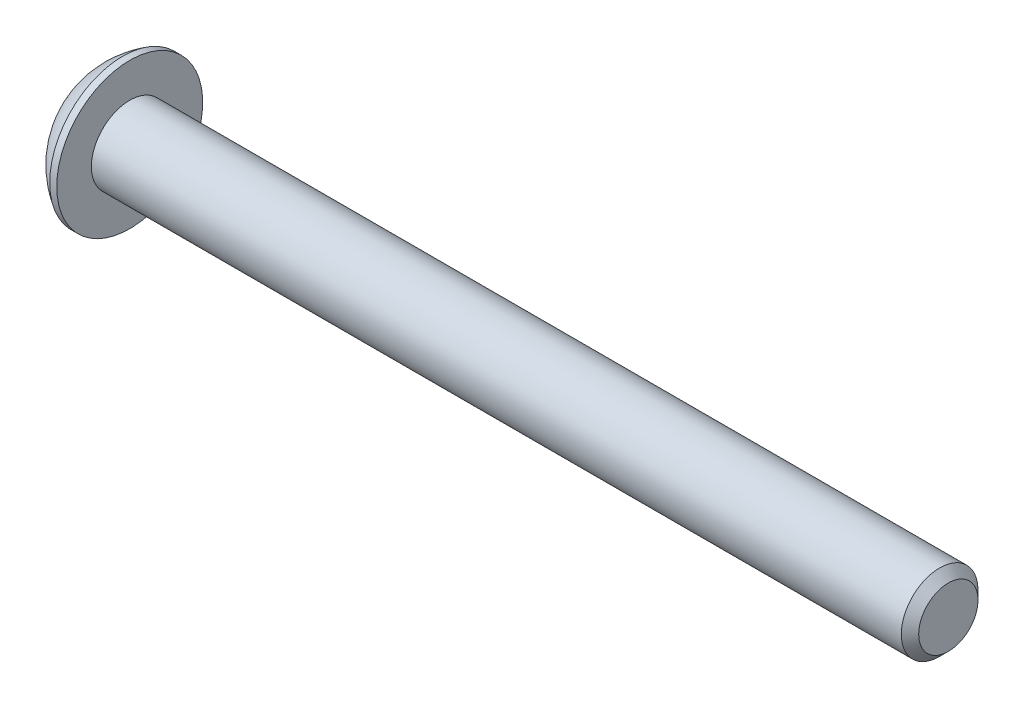
ISO-10303-21;
HEADER;
FILE_DESCRIPTION(('STEP AP214'),'2;1');
FILE_NAME('part.step','',(''),(''),'','','');
FILE_SCHEMA(('AUTOMOTIVE_DESIGN { 1 0 10303 214 1 1 1 1 }'));
ENDSEC;
DATA;
#1=APPLICATION_CONTEXT('core data for automotive mechanical design processes');
#2=APPLICATION_PROTOCOL_DEFINITION('international standard','automotive_design',2000,#1);
#3=PRODUCT_CONTEXT('',#1,'mechanical');
#4=PRODUCT('Part','Part','',(#3));
#5=PRODUCT_RELATED_PRODUCT_CATEGORY('part','',(#4));
#6=PRODUCT_DEFINITION_FORMATION('','',#4);
#7=PRODUCT_DEFINITION_CONTEXT('part definition',#1,'design');
#8=PRODUCT_DEFINITION('design','',#6,#7);
#9=PRODUCT_DEFINITION_SHAPE('','',#8);
#10=(LENGTH_UNIT() NAMED_UNIT(*) SI_UNIT(.MILLI.,.METRE.));
#11=(NAMED_UNIT(*) PLANE_ANGLE_UNIT() SI_UNIT($,.RADIAN.));
#12=(NAMED_UNIT(*) SI_UNIT($,.STERADIAN.) SOLID_ANGLE_UNIT());
#13=UNCERTAINTY_MEASURE_WITH_UNIT(LENGTH_MEASURE(1.E-05),#10,'distance_accuracy_value','');
#14=(GEOMETRIC_REPRESENTATION_CONTEXT(3) GLOBAL_UNCERTAINTY_ASSIGNED_CONTEXT((#13)) GLOBAL_UNIT_ASSIGNED_CONTEXT((#10,
#11,#12)) REPRESENTATION_CONTEXT('',''));
#15=CARTESIAN_POINT('',(0.,0.,0.));
#16=DIRECTION('',(0.,0.,1.));
#17=DIRECTION('',(1.,0.,0.));
#18=AXIS2_PLACEMENT_3D('',#15,#16,#17);
#19=CARTESIAN_POINT('',(1.32080000000034,0.,0.));
#20=DIRECTION('',(-1.,0.,0.));
#21=DIRECTION('',(0.,0.,1.));
#22=AXIS2_PLACEMENT_3D('',#19,#20,#21);
#23=CONICAL_SURFACE('',#22,1.1937999999998,1.04719755119608);
#24=CARTESIAN_POINT('',(2.01004075135902,0.,4.44089209850063E-13));
#25=VERTEX_POINT('',#24);
#26=VERTEX_LOOP('',#25);
#27=FACE_BOUND('',#26,.T.);
#28=CARTESIAN_POINT('',(1.32080000000009,0.,0.));
#29=DIRECTION('',(-1.,0.,0.));
#30=DIRECTION('',(0.,0.,1.));
#31=AXIS2_PLACEMENT_3D('',#28,#29,#30);
#32=CIRCLE('',#31,1.19380000000024);
#33=CARTESIAN_POINT('',(1.32080000000004,0.,1.19380000000012));
#34=VERTEX_POINT('',#33);
#35=CARTESIAN_POINT('',(1.32080000000004,-1.03386112703797,0.596900000000061));
#36=VERTEX_POINT('',#35);
#37=EDGE_CURVE('E20',#34,#36,#32,.F.);
#38=ORIENTED_EDGE('',*,*,#37,.F.);
#39=CARTESIAN_POINT('',(1.32080000000009,0.,0.));
#40=DIRECTION('',(-1.,0.,0.));
#41=DIRECTION('',(0.,0.,1.));
#42=AXIS2_PLACEMENT_3D('',#39,#40,#41);
#43=CIRCLE('',#42,1.19380000000024);
#44=CARTESIAN_POINT('',(1.32080000000004,1.03386112703797,0.596900000000063));
#45=VERTEX_POINT('',#44);
#46=EDGE_CURVE('E90',#45,#34,#43,.F.);
#47=ORIENTED_EDGE('',*,*,#46,.F.);
#48=CARTESIAN_POINT('',(1.32080000000009,0.,0.));
#49=DIRECTION('',(-1.,0.,0.));
#50=DIRECTION('',(0.,0.,1.));
#51=AXIS2_PLACEMENT_3D('',#48,#49,#50);
#52=CIRCLE('',#51,1.19380000000024);
#53=CARTESIAN_POINT('',(1.32080000000004,1.03386112703797,-0.596900000000063));
#54=VERTEX_POINT('',#53);
#55=EDGE_CURVE('E106',#54,#45,#52,.F.);
#56=ORIENTED_EDGE('',*,*,#55,.F.);
#57=CARTESIAN_POINT('',(1.32080000000009,0.,0.));
#58=DIRECTION('',(-1.,0.,0.));
#59=DIRECTION('',(0.,0.,1.));
#60=AXIS2_PLACEMENT_3D('',#57,#58,#59);
#61=CIRCLE('',#60,1.19380000000024);
#62=CARTESIAN_POINT('',(1.32080000000004,1.49420287879031E-12,-1.19380000000012));
#63=VERTEX_POINT('',#62);
#64=EDGE_CURVE('E449',#63,#54,#61,.F.);
#65=ORIENTED_EDGE('',*,*,#64,.F.);
#66=CARTESIAN_POINT('',(1.32080000000009,0.,0.));
#67=DIRECTION('',(-1.,0.,0.));
#68=DIRECTION('',(0.,0.,1.));
#69=AXIS2_PLACEMENT_3D('',#66,#67,#68);
#70=CIRCLE('',#69,1.19380000000024);
#71=CARTESIAN_POINT('',(1.32080000000004,-1.03386112703797,-0.596900000000062));
#72=VERTEX_POINT('',#71);
#73=EDGE_CURVE('E452',#72,#63,#70,.F.);
#74=ORIENTED_EDGE('',*,*,#73,.F.);
#75=CARTESIAN_POINT('',(1.32080000000009,0.,0.));
#76=DIRECTION('',(-1.,0.,0.));
#77=DIRECTION('',(0.,0.,1.));
#78=AXIS2_PLACEMENT_3D('',#75,#76,#77);
#79=CIRCLE('',#78,1.19380000000024);
#80=EDGE_CURVE('E93',#36,#72,#79,.F.);
#81=ORIENTED_EDGE('',*,*,#80,.F.);
#82=EDGE_LOOP('',(#38,#47,#56,#65,#74,#81));
#83=FACE_BOUND('',#82,.T.);
#84=ADVANCED_FACE('F17',(#27,#83),#23,.F.);
#85=CARTESIAN_POINT('',(1.3208,0.,2.3876));
#86=DIRECTION('',(-1.,0.,0.));
#87=DIRECTION('',(0.,0.,1.));
#88=AXIS2_PLACEMENT_3D('',#85,#86,#87);
#89=PLANE('',#88);
#90=DIRECTION('',(0.,1.,0.));
#91=VECTOR('',#90,1.);
#92=CARTESIAN_POINT('',(1.3208,-0.689240751358576,1.1938));
#93=LINE('',#92,#91);
#94=CARTESIAN_POINT('',(1.3208,-0.689240751358576,1.1938));
#95=VERTEX_POINT('',#94);
#96=EDGE_CURVE('E109',#34,#95,#93,.F.);
#97=ORIENTED_EDGE('',*,*,#96,.F.);
#98=ORIENTED_EDGE('',*,*,#37,.T.);
#99=DIRECTION('',(0.,0.5,0.866025403784439));
#100=VECTOR('',#99,1.);
#101=CARTESIAN_POINT('',(1.3208,-1.37848150271715,0.));
#102=LINE('',#101,#100);
#103=EDGE_CURVE('E112',#95,#36,#102,.F.);
#104=ORIENTED_EDGE('',*,*,#103,.F.);
#105=EDGE_LOOP('',(#97,#98,#104));
#106=FACE_BOUND('',#105,.T.);
#107=ADVANCED_FACE('F110',(#106),#89,.T.);
#108=CARTESIAN_POINT('',(1.3208,0.,2.3876));
#109=DIRECTION('',(-1.,0.,0.));
#110=DIRECTION('',(0.,0.,1.));
#111=AXIS2_PLACEMENT_3D('',#108,#109,#110);
#112=PLANE('',#111);
#113=DIRECTION('',(0.,0.5,0.866025403784439));
#114=VECTOR('',#113,1.);
#115=CARTESIAN_POINT('',(1.3208,-1.37848150271715,0.));
#116=LINE('',#115,#114);
#117=CARTESIAN_POINT('',(1.3208,-1.37848150271715,0.));
#118=VERTEX_POINT('',#117);
#119=EDGE_CURVE('E172',#36,#118,#116,.F.);
#120=ORIENTED_EDGE('',*,*,#119,.F.);
#121=ORIENTED_EDGE('',*,*,#80,.T.);
#122=DIRECTION('',(0.,-0.5,0.866025403784439));
#123=VECTOR('',#122,1.);
#124=CARTESIAN_POINT('',(1.3208,-0.689240751358576,-1.1938));
#125=LINE('',#124,#123);
#126=EDGE_CURVE('E160',#118,#72,#125,.F.);
#127=ORIENTED_EDGE('',*,*,#126,.F.);
#128=EDGE_LOOP('',(#120,#121,#127));
#129=FACE_BOUND('',#128,.T.);
#130=ADVANCED_FACE('F249',(#129),#112,.T.);
#131=CARTESIAN_POINT('',(1.3208,0.,2.3876));
#132=DIRECTION('',(-1.,0.,0.));
#133=DIRECTION('',(0.,0.,1.));
#134=AXIS2_PLACEMENT_3D('',#131,#132,#133);
#135=PLANE('',#134);
#136=DIRECTION('',(0.,-0.5,0.866025403784439));
#137=VECTOR('',#136,1.);
#138=CARTESIAN_POINT('',(1.3208,-0.689240751358576,-1.1938));
#139=LINE('',#138,#137);
#140=CARTESIAN_POINT('',(1.3208,-0.689240751358576,-1.1938));
#141=VERTEX_POINT('',#140);
#142=EDGE_CURVE('E157',#72,#141,#139,.F.);
#143=ORIENTED_EDGE('',*,*,#142,.F.);
#144=ORIENTED_EDGE('',*,*,#73,.T.);
#145=DIRECTION('',(0.,-1.,0.));
#146=VECTOR('',#145,1.);
#147=CARTESIAN_POINT('',(1.3208,0.689240751358575,-1.1938));
#148=LINE('',#147,#146);
#149=EDGE_CURVE('E144',#141,#63,#148,.F.);
#150=ORIENTED_EDGE('',*,*,#149,.F.);
#151=EDGE_LOOP('',(#143,#144,#150));
#152=FACE_BOUND('',#151,.T.);
#153=ADVANCED_FACE('F245',(#152),#135,.T.);
#154=CARTESIAN_POINT('',(1.3208,0.,2.3876));
#155=DIRECTION('',(-1.,0.,0.));
#156=DIRECTION('',(0.,0.,1.));
#157=AXIS2_PLACEMENT_3D('',#154,#155,#156);
#158=PLANE('',#157);
#159=DIRECTION('',(0.,-1.,0.));
#160=VECTOR('',#159,1.);
#161=CARTESIAN_POINT('',(1.3208,0.689240751358575,-1.1938));
#162=LINE('',#161,#160);
#163=CARTESIAN_POINT('',(1.3208,0.689240751358575,-1.1938));
#164=VERTEX_POINT('',#163);
#165=EDGE_CURVE('E141',#63,#164,#162,.F.);
#166=ORIENTED_EDGE('',*,*,#165,.F.);
#167=ORIENTED_EDGE('',*,*,#64,.T.);
#168=DIRECTION('',(0.,-0.500000000000001,-0.866025403784438));
#169=VECTOR('',#168,1.);
#170=CARTESIAN_POINT('',(1.3208,1.37848150271715,0.));
#171=LINE('',#170,#169);
#172=EDGE_CURVE('E129',#164,#54,#171,.F.);
#173=ORIENTED_EDGE('',*,*,#172,.F.);
#174=EDGE_LOOP('',(#166,#167,#173));
#175=FACE_BOUND('',#174,.T.);
#176=ADVANCED_FACE('F241',(#175),#158,.T.);
#177=CARTESIAN_POINT('',(1.3208,0.,2.3876));
#178=DIRECTION('',(-1.,0.,0.));
#179=DIRECTION('',(0.,0.,1.));
#180=AXIS2_PLACEMENT_3D('',#177,#178,#179);
#181=PLANE('',#180);
#182=DIRECTION('',(0.,-0.500000000000001,-0.866025403784438));
#183=VECTOR('',#182,1.);
#184=CARTESIAN_POINT('',(1.3208,1.37848150271715,0.));
#185=LINE('',#184,#183);
#186=CARTESIAN_POINT('',(1.3208,1.37848150271715,0.));
#187=VERTEX_POINT('',#186);
#188=EDGE_CURVE('E126',#54,#187,#185,.F.);
#189=ORIENTED_EDGE('',*,*,#188,.F.);
#190=ORIENTED_EDGE('',*,*,#55,.T.);
#191=DIRECTION('',(0.,0.500000000000001,-0.866025403784438));
#192=VECTOR('',#191,1.);
#193=CARTESIAN_POINT('',(1.3208,0.689240751358575,1.1938));
#194=LINE('',#193,#192);
#195=EDGE_CURVE('E149',#187,#45,#194,.F.);
#196=ORIENTED_EDGE('',*,*,#195,.F.);
#197=EDGE_LOOP('',(#189,#190,#196));
#198=FACE_BOUND('',#197,.T.);
#199=ADVANCED_FACE('F238',(#198),#181,.T.);
#200=CARTESIAN_POINT('',(1.3208,0.,2.3876));
#201=DIRECTION('',(-1.,0.,0.));
#202=DIRECTION('',(0.,0.,1.));
#203=AXIS2_PLACEMENT_3D('',#200,#201,#202);
#204=PLANE('',#203);
#205=DIRECTION('',(0.,0.500000000000001,-0.866025403784438));
#206=VECTOR('',#205,1.);
#207=CARTESIAN_POINT('',(1.3208,0.689240751358575,1.1938));
#208=LINE('',#207,#206);
#209=CARTESIAN_POINT('',(1.3208,0.689240751358575,1.1938));
#210=VERTEX_POINT('',#209);
#211=EDGE_CURVE('E104',#45,#210,#208,.F.);
#212=ORIENTED_EDGE('',*,*,#211,.F.);
#213=ORIENTED_EDGE('',*,*,#46,.T.);
#214=DIRECTION('',(0.,1.,0.));
#215=VECTOR('',#214,1.);
#216=CARTESIAN_POINT('',(1.3208,-0.689240751358576,1.1938));
#217=LINE('',#216,#215);
#218=EDGE_CURVE('E101',#210,#34,#217,.F.);
#219=ORIENTED_EDGE('',*,*,#218,.F.);
#220=EDGE_LOOP('',(#212,#213,#219));
#221=FACE_BOUND('',#220,.T.);
#222=ADVANCED_FACE('F99',(#221),#204,.T.);
#223=CARTESIAN_POINT('',(1.3208,-0.689240751358576,1.1938));
#224=DIRECTION('',(0.,0.,-1.));
#225=DIRECTION('',(0.,1.,0.));
#226=AXIS2_PLACEMENT_3D('',#223,#224,#225);
#227=PLANE('',#226);
#228=DIRECTION('',(0.,1.,0.));
#229=VECTOR('',#228,1.);
#230=CARTESIAN_POINT('',(0.,0.,1.1938));
#231=LINE('',#230,#229);
#232=CARTESIAN_POINT('',(0.,0.689240751358575,1.1938));
#233=VERTEX_POINT('',#232);
#234=CARTESIAN_POINT('',(0.,-0.689240751358576,1.1938));
#235=VERTEX_POINT('',#234);
#236=EDGE_CURVE('E133',#233,#235,#231,.F.);
#237=ORIENTED_EDGE('',*,*,#236,.F.);
#238=DIRECTION('',(1.,0.,0.));
#239=VECTOR('',#238,1.);
#240=CARTESIAN_POINT('',(1.3208,0.689240751358575,1.1938));
#241=LINE('',#240,#239);
#242=EDGE_CURVE('E118',#210,#233,#241,.F.);
#243=ORIENTED_EDGE('',*,*,#242,.F.);
#244=ORIENTED_EDGE('',*,*,#218,.T.);
#245=ORIENTED_EDGE('',*,*,#96,.T.);
#246=DIRECTION('',(1.,0.,0.));
#247=VECTOR('',#246,1.);
#248=CARTESIAN_POINT('',(1.3208,-0.689240751358576,1.1938));
#249=LINE('',#248,#247);
#250=EDGE_CURVE('E169',#235,#95,#249,.T.);
#251=ORIENTED_EDGE('',*,*,#250,.F.);
#252=EDGE_LOOP('',(#237,#243,#244,#245,#251));
#253=FACE_BOUND('',#252,.T.);
#254=ADVANCED_FACE('F116',(#253),#227,.T.);
#255=CARTESIAN_POINT('',(1.3208,-1.37848150271715,0.));
#256=DIRECTION('',(0.,0.866025403784439,-0.5));
#257=DIRECTION('',(0.,0.5,0.866025403784439));
#258=AXIS2_PLACEMENT_3D('',#255,#256,#257);
#259=PLANE('',#258);
#260=DIRECTION('',(0.,-0.5,-0.866025403784439));
#261=VECTOR('',#260,1.);
#262=CARTESIAN_POINT('',(0.,-0.689240751358576,1.1938));
#263=LINE('',#262,#261);
#264=CARTESIAN_POINT('',(0.,-1.37848150271715,0.));
#265=VERTEX_POINT('',#264);
#266=EDGE_CURVE('E436',#235,#265,#263,.T.);
#267=ORIENTED_EDGE('',*,*,#266,.F.);
#268=ORIENTED_EDGE('',*,*,#250,.T.);
#269=ORIENTED_EDGE('',*,*,#103,.T.);
#270=ORIENTED_EDGE('',*,*,#119,.T.);
#271=DIRECTION('',(1.,0.,0.));
#272=VECTOR('',#271,1.);
#273=CARTESIAN_POINT('',(1.3208,-1.37848150271715,0.));
#274=LINE('',#273,#272);
#275=EDGE_CURVE('E154',#265,#118,#274,.T.);
#276=ORIENTED_EDGE('',*,*,#275,.F.);
#277=EDGE_LOOP('',(#267,#268,#269,#270,#276));
#278=FACE_BOUND('',#277,.T.);
#279=ADVANCED_FACE('F229',(#278),#259,.T.);
#280=CARTESIAN_POINT('',(1.3208,-0.689240751358576,-1.1938));
#281=DIRECTION('',(0.,0.866025403784439,0.5));
#282=DIRECTION('',(0.,-0.5,0.866025403784439));
#283=AXIS2_PLACEMENT_3D('',#280,#281,#282);
#284=PLANE('',#283);
#285=DIRECTION('',(0.,0.5,-0.866025403784439));
#286=VECTOR('',#285,1.);
#287=CARTESIAN_POINT('',(0.,-1.37848150271715,0.));
#288=LINE('',#287,#286);
#289=CARTESIAN_POINT('',(0.,-0.689240751358576,-1.1938));
#290=VERTEX_POINT('',#289);
#291=EDGE_CURVE('E433',#265,#290,#288,.T.);
#292=ORIENTED_EDGE('',*,*,#291,.F.);
#293=ORIENTED_EDGE('',*,*,#275,.T.);
#294=ORIENTED_EDGE('',*,*,#126,.T.);
#295=ORIENTED_EDGE('',*,*,#142,.T.);
#296=DIRECTION('',(1.,0.,0.));
#297=VECTOR('',#296,1.);
#298=CARTESIAN_POINT('',(1.3208,-0.689240751358576,-1.1938));
#299=LINE('',#298,#297);
#300=EDGE_CURVE('E138',#290,#141,#299,.T.);
#301=ORIENTED_EDGE('',*,*,#300,.F.);
#302=EDGE_LOOP('',(#292,#293,#294,#295,#301));
#303=FACE_BOUND('',#302,.T.);
#304=ADVANCED_FACE('F225',(#303),#284,.T.);
#305=CARTESIAN_POINT('',(1.3208,0.689240751358575,-1.1938));
#306=DIRECTION('',(0.,0.,1.));
#307=DIRECTION('',(0.,-1.,0.));
#308=AXIS2_PLACEMENT_3D('',#305,#306,#307);
#309=PLANE('',#308);
#310=DIRECTION('',(0.,1.,0.));
#311=VECTOR('',#310,1.);
#312=CARTESIAN_POINT('',(0.,0.,-1.1938));
#313=LINE('',#312,#311);
#314=CARTESIAN_POINT('',(0.,0.689240751358575,-1.1938));
#315=VERTEX_POINT('',#314);
#316=EDGE_CURVE('E430',#290,#315,#313,.T.);
#317=ORIENTED_EDGE('',*,*,#316,.F.);
#318=ORIENTED_EDGE('',*,*,#300,.T.);
#319=ORIENTED_EDGE('',*,*,#149,.T.);
#320=ORIENTED_EDGE('',*,*,#165,.T.);
#321=DIRECTION('',(1.,0.,0.));
#322=VECTOR('',#321,1.);
#323=CARTESIAN_POINT('',(1.3208,0.689240751358575,-1.1938));
#324=LINE('',#323,#322);
#325=EDGE_CURVE('E128',#315,#164,#324,.T.);
#326=ORIENTED_EDGE('',*,*,#325,.F.);
#327=EDGE_LOOP('',(#317,#318,#319,#320,#326));
#328=FACE_BOUND('',#327,.T.);
#329=ADVANCED_FACE('F222',(#328),#309,.T.);
#330=CARTESIAN_POINT('',(1.3208,1.37848150271715,0.));
#331=DIRECTION('',(0.,-0.866025403784438,0.500000000000001));
#332=DIRECTION('',(0.,-0.500000000000001,-0.866025403784438));
#333=AXIS2_PLACEMENT_3D('',#330,#331,#332);
#334=PLANE('',#333);
#335=DIRECTION('',(0.,0.500000000000001,0.866025403784438));
#336=VECTOR('',#335,1.);
#337=CARTESIAN_POINT('',(0.,0.689240751358575,-1.1938));
#338=LINE('',#337,#336);
#339=CARTESIAN_POINT('',(0.,1.37848150271715,0.));
#340=VERTEX_POINT('',#339);
#341=EDGE_CURVE('E427',#315,#340,#338,.T.);
#342=ORIENTED_EDGE('',*,*,#341,.F.);
#343=ORIENTED_EDGE('',*,*,#325,.T.);
#344=ORIENTED_EDGE('',*,*,#172,.T.);
#345=ORIENTED_EDGE('',*,*,#188,.T.);
#346=DIRECTION('',(1.,0.,0.));
#347=VECTOR('',#346,1.);
#348=CARTESIAN_POINT('',(1.3208,1.37848150271715,0.));
#349=LINE('',#348,#347);
#350=EDGE_CURVE('E35',#340,#187,#349,.T.);
#351=ORIENTED_EDGE('',*,*,#350,.F.);
#352=EDGE_LOOP('',(#342,#343,#344,#345,#351));
#353=FACE_BOUND('',#352,.T.);
#354=ADVANCED_FACE('F218',(#353),#334,.T.);
#355=CARTESIAN_POINT('',(1.3208,0.689240751358575,1.1938));
#356=DIRECTION('',(0.,-0.866025403784438,-0.500000000000001));
#357=DIRECTION('',(0.,0.500000000000001,-0.866025403784438));
#358=AXIS2_PLACEMENT_3D('',#355,#356,#357);
#359=PLANE('',#358);
#360=DIRECTION('',(0.,-0.500000000000001,0.866025403784438));
#361=VECTOR('',#360,1.);
#362=CARTESIAN_POINT('',(0.,1.37848150271715,0.));
#363=LINE('',#362,#361);
#364=EDGE_CURVE('E204',#340,#233,#363,.T.);
#365=ORIENTED_EDGE('',*,*,#364,.F.);
#366=ORIENTED_EDGE('',*,*,#350,.T.);
#367=ORIENTED_EDGE('',*,*,#195,.T.);
#368=ORIENTED_EDGE('',*,*,#211,.T.);
#369=ORIENTED_EDGE('',*,*,#242,.T.);
#370=EDGE_LOOP('',(#365,#366,#367,#368,#369));
#371=FACE_BOUND('',#370,.T.);
#372=ADVANCED_FACE('F214',(#371),#359,.T.);
#373=CARTESIAN_POINT('',(0.,0.,0.));
#374=DIRECTION('',(-1.,0.,0.));
#375=DIRECTION('',(0.,0.,1.));
#376=AXIS2_PLACEMENT_3D('',#373,#374,#375);
#377=PLANE('',#376);
#378=ORIENTED_EDGE('',*,*,#341,.T.);
#379=ORIENTED_EDGE('',*,*,#364,.T.);
#380=ORIENTED_EDGE('',*,*,#236,.T.);
#381=ORIENTED_EDGE('',*,*,#266,.T.);
#382=ORIENTED_EDGE('',*,*,#291,.T.);
#383=ORIENTED_EDGE('',*,*,#316,.T.);
#384=EDGE_LOOP('',(#378,#379,#380,#381,#382,#383));
#385=FACE_BOUND('',#384,.T.);
#386=CARTESIAN_POINT('',(0.,1.9812,0.));
#387=CARTESIAN_POINT('',(0.,1.9811996664299,0.0556258831179428));
#388=CARTESIAN_POINT('',(0.,1.97885520380442,0.111261989398606));
#389=CARTESIAN_POINT('',(0.,1.96949260169541,0.222149719830457));
#390=CARTESIAN_POINT('',(0.,1.96247308239605,0.277401225602895));
#391=CARTESIAN_POINT('',(0.,1.94379192841038,0.387209508139748));
#392=CARTESIAN_POINT('',(-1.85349662675075E-13,1.93212292489526,0.441765039546366));
#393=CARTESIAN_POINT('',(1.86368103073899E-13,1.90422331175315,0.549729449347494));
#394=CARTESIAN_POINT('',(6.94660217931763E-13,1.88798900035338,0.60313735920887));
#395=CARTESIAN_POINT('',(1.15478661709244E-12,1.832662144765,0.760839131321828));
#396=CARTESIAN_POINT('',(0.,1.78690023648845,0.862876433575428));
#397=CARTESIAN_POINT('',(0.,1.67887358150667,1.05780719540872));
#398=CARTESIAN_POINT('',(9.59166308439208E-13,1.6166082074585,1.15070030720801));
#399=CARTESIAN_POINT('',(5.97522230379926E-13,1.51224157140982,1.28116890915698));
#400=CARTESIAN_POINT('',(1.63887930099895E-13,1.4755970394354,1.32320451127026));
#401=CARTESIAN_POINT('',(-1.62862973846925E-13,1.39893832619713,1.40400288695709));
#402=CARTESIAN_POINT('',(0.,1.35892742784699,1.44276877695455));
#403=CARTESIAN_POINT('',(1.14265143167175E-13,1.23416504602197,1.55382272417904));
#404=CARTESIAN_POINT('',(0.,1.14466125559859,1.62089527952111));
#405=CARTESIAN_POINT('',(0.,0.955712144178159,1.73902218081179));
#406=CARTESIAN_POINT('',(0.,0.856267198233559,1.79007713076007));
#407=CARTESIAN_POINT('',(0.,0.65020634591084,1.87477637530954));
#408=CARTESIAN_POINT('',(0.,0.543590516134851,1.90842085586267));
#409=CARTESIAN_POINT('',(0.,0.326226155292015,1.95733039300656));
#410=CARTESIAN_POINT('',(0.,0.215477602157927,1.97259535144288));
#411=CARTESIAN_POINT('',(0.,-0.00701040587544946,1.98431697865418));
#412=CARTESIAN_POINT('',(0.,-0.118749860774737,1.98077364742917));
#413=CARTESIAN_POINT('',(0.,-0.340050178355489,1.95497485623825));
#414=CARTESIAN_POINT('',(0.,-0.449611052668259,1.93271949620218));
#415=CARTESIAN_POINT('',(0.,-0.663431110729178,1.87014138774524));
#416=CARTESIAN_POINT('',(0.,-0.767690237838526,1.82981844635273));
#417=CARTESIAN_POINT('',(0.,-0.968005760719351,1.73219968377097));
#418=CARTESIAN_POINT('',(0.,-1.0640618469811,1.6749032225164));
#419=CARTESIAN_POINT('',(0.,-1.19980276751284,1.57757371205873));
#420=CARTESIAN_POINT('',(0.,-1.24366557129214,1.54322665019466));
#421=CARTESIAN_POINT('',(0.,-1.32838995706696,1.47093063174264));
#422=CARTESIAN_POINT('',(0.,-1.36924860178707,1.4329782310244));
#423=CARTESIAN_POINT('',(0.,-1.48674671849223,1.31419842051173));
#424=CARTESIAN_POINT('',(0.,-1.55842832343238,1.22836221289312));
#425=CARTESIAN_POINT('',(0.,-1.6863396856475,1.04586168272493));
#426=CARTESIAN_POINT('',(0.,-1.7425700302488,0.949197771949773));
#427=CARTESIAN_POINT('',(0.,-1.81416142504011,0.798182600298683));
#428=CARTESIAN_POINT('',(0.,-1.83591780585876,0.746776203847791));
#429=CARTESIAN_POINT('',(0.,-1.87500754181093,0.642341081688636));
#430=CARTESIAN_POINT('',(0.,-1.89234447645405,0.589313708122847));
#431=CARTESIAN_POINT('',(0.,-1.92246053433555,0.482076273028394));
#432=CARTESIAN_POINT('',(0.,-1.93524685475118,0.427868224257509));
#433=CARTESIAN_POINT('',(0.,-1.95620937250495,0.318578151844611));
#434=CARTESIAN_POINT('',(0.,-1.96438692958148,0.263496390912872));
#435=CARTESIAN_POINT('',(0.,-1.97388528284654,0.173607715038558));
#436=CARTESIAN_POINT('',(0.,-1.97662743364427,0.138944718024998));
#437=CARTESIAN_POINT('',(0.,-1.98028489645284,0.0695224782567003));
#438=CARTESIAN_POINT('',(0.,-1.98120020846368,0.0347632355019632));
#439=CARTESIAN_POINT('',(0.,-1.98119966642991,-0.0556258831179438));
#440=CARTESIAN_POINT('',(0.,-1.97885520380443,-0.111261989398607));
#441=CARTESIAN_POINT('',(0.,-1.96949260169542,-0.222149719830459));
#442=CARTESIAN_POINT('',(0.,-1.96247308239606,-0.277401225602897));
#443=CARTESIAN_POINT('',(0.,-1.94379192841039,-0.387209508139749));
#444=CARTESIAN_POINT('',(-1.8566353772123E-13,-1.93212292489527,-0.441765039546366));
#445=CARTESIAN_POINT('',(1.86682233362643E-13,-1.90422331175316,-0.549729449347494));
#446=CARTESIAN_POINT('',(6.9585130633184E-13,-1.88798900035339,-0.603137359208871));
#447=CARTESIAN_POINT('',(1.15760601927604E-12,-1.83266214476501,-0.76083913132183));
#448=CARTESIAN_POINT('',(0.,-1.78690023648846,-0.86287643357543));
#449=CARTESIAN_POINT('',(0.,-1.67887358150667,-1.05780719540872));
#450=CARTESIAN_POINT('',(9.5167678984173E-13,-1.61660820745851,-1.15070030720801));
#451=CARTESIAN_POINT('',(5.93462231366705E-13,-1.51224157140983,-1.28116890915698));
#452=CARTESIAN_POINT('',(1.62776229376343E-13,-1.4755970394354,-1.32320451127027));
#453=CARTESIAN_POINT('',(-1.6175234497031E-13,-1.39893832619714,-1.40400288695709));
#454=CARTESIAN_POINT('',(0.,-1.35892742784699,-1.44276877695455));
#455=CARTESIAN_POINT('',(1.13488992252336E-13,-1.23416504602198,-1.55382272417904));
#456=CARTESIAN_POINT('',(0.,-1.1446612555986,-1.62089527952111));
#457=CARTESIAN_POINT('',(0.,-0.955712144178171,-1.7390221808118));
#458=CARTESIAN_POINT('',(0.,-0.856267198233569,-1.79007713076007));
#459=CARTESIAN_POINT('',(0.,-0.650206345910847,-1.87477637530954));
#460=CARTESIAN_POINT('',(0.,-0.543590516134859,-1.90842085586267));
#461=CARTESIAN_POINT('',(0.,-0.326226155292022,-1.95733039300656));
#462=CARTESIAN_POINT('',(0.,-0.215477602157934,-1.97259535144288));
#463=CARTESIAN_POINT('',(0.,0.00701040587544248,-1.98431697865418));
#464=CARTESIAN_POINT('',(0.,0.11874986077473,-1.98077364742916));
#465=CARTESIAN_POINT('',(0.,0.340050178355482,-1.95497485623824));
#466=CARTESIAN_POINT('',(0.,0.449611052668252,-1.93271949620218));
#467=CARTESIAN_POINT('',(0.,0.663431110729172,-1.87014138774524));
#468=CARTESIAN_POINT('',(0.,0.767690237838519,-1.82981844635273));
#469=CARTESIAN_POINT('',(0.,0.968005760719343,-1.73219968377097));
#470=CARTESIAN_POINT('',(0.,1.06406184698109,-1.6749032225164));
#471=CARTESIAN_POINT('',(0.,1.19980276751283,-1.57757371205873));
#472=CARTESIAN_POINT('',(0.,1.24366557129213,-1.54322665019466));
#473=CARTESIAN_POINT('',(0.,1.32838995706696,-1.47093063174264));
#474=CARTESIAN_POINT('',(0.,1.36924860178706,-1.4329782310244));
#475=CARTESIAN_POINT('',(0.,1.48674671849222,-1.31419842051173));
#476=CARTESIAN_POINT('',(0.,1.55842832343237,-1.22836221289311));
#477=CARTESIAN_POINT('',(0.,1.6863396856475,-1.04586168272493));
#478=CARTESIAN_POINT('',(0.,1.7425700302488,-0.949197771949774));
#479=CARTESIAN_POINT('',(0.,1.8141614250401,-0.798182600298684));
#480=CARTESIAN_POINT('',(0.,1.83591780585875,-0.746776203847791));
#481=CARTESIAN_POINT('',(0.,1.87500754181092,-0.642341081688635));
#482=CARTESIAN_POINT('',(0.,1.89234447645404,-0.589313708122846));
#483=CARTESIAN_POINT('',(0.,1.92246053433554,-0.482076273028394));
#484=CARTESIAN_POINT('',(0.,1.93524685475118,-0.42786822425751));
#485=CARTESIAN_POINT('',(0.,1.95620937250493,-0.318578151844611));
#486=CARTESIAN_POINT('',(0.,1.96438692958147,-0.263496390912871));
#487=CARTESIAN_POINT('',(0.,1.97388528284653,-0.173607715038558));
#488=CARTESIAN_POINT('',(0.,1.97662743364427,-0.138944718024998));
#489=CARTESIAN_POINT('',(0.,1.98028489645283,-0.0695224782567008));
#490=CARTESIAN_POINT('',(0.,1.98120020846367,-0.034763235501964));
#491=CARTESIAN_POINT('',(0.,1.9812,0.));
#492=B_SPLINE_CURVE_WITH_KNOTS('',3,(#386,#387,#388,#389,#390,#391,#392,#393,#394,#395,#396,
#397,#398,#399,#400,#401,#402,#403,#404,#405,#406,#407,#408,#409,#410,#411,#412,#413,#414,#415,
#416,#417,#418,#419,#420,#421,#422,#423,#424,#425,#426,#427,#428,#429,#430,#431,#432,#433,#434,
#435,#436,#437,#438,#439,#440,#441,#442,#443,#444,#445,#446,#447,#448,#449,#450,#451,#452,#453,
#454,#455,#456,#457,#458,#459,#460,#461,#462,#463,#464,#465,#466,#467,#468,#469,#470,#471,#472,
#473,#474,#475,#476,#477,#478,#479,#480,#481,#482,#483,#484,#485,#486,#487,#488,#489,#490,#491),
.UNSPECIFIED.,.T.,.F.,(4,2,2,2,2,2,2,2,2,2,2,2,2,2,2,2,2,2,2,2,2,2,2,2,2,2,2,2,2,2,2,2,2,2,2,2,
2,2,2,2,2,2,2,2,2,2,2,2,2,2,2,2,4),(0.,0.166845646007828,0.333740557374255,0.500901034367694,
0.668197445942387,1.00199278686282,1.33580081809885,1.50292354032982,1.6698851310853,
2.00370118900129,2.33750465770544,2.67130456115909,3.00510624723801,3.33890793331696,
3.67270783677065,4.00651130547476,4.34032736339027,4.50728895414555,4.67441167637632,
5.0082197076126,5.34201504853333,5.50931146010828,5.67647193710192,5.84336684846845,
6.01021249447641,6.11448220058335,6.2187519066903,6.38559755269813,6.55249246406455,
6.71965294105799,6.88694935263269,7.22074469355312,7.55455272478915,7.72167544702012,
7.8886370377756,8.22245309569159,8.55625656439574,8.89005646784939,9.22385815392831,
9.55765984000726,9.89145974346095,10.2252632121651,10.5590792700806,10.7260408608358,
10.8931635830666,11.2269716143029,11.5607669552236,11.7280633667986,11.8952238437922,
12.0621187551587,12.2289644011667,12.3332341072736,12.4375038133806),.UNSPECIFIED.);
#493=CARTESIAN_POINT('',(0.,1.9812,0.));
#494=VERTEX_POINT('',#493);
#495=EDGE_CURVE('E198',#494,#494,#492,.T.);
#496=ORIENTED_EDGE('',*,*,#495,.F.);
#497=EDGE_LOOP('',(#496));
#498=FACE_BOUND('',#497,.T.);
#499=ADVANCED_FACE('F210',(#385,#498),#377,.T.);
#500=CARTESIAN_POINT('',(4.13385000000001,0.,0.));
#501=DIRECTION('',(0.,1.,0.));
#502=DIRECTION('',(1.,0.,0.));
#503=AXIS2_PLACEMENT_3D('',#500,#501,#502);
#504=SPHERICAL_SURFACE('',#503,4.5840887057844);
#505=CARTESIAN_POINT('',(1.8288,0.,0.));
#506=DIRECTION('',(-1.,0.,0.));
#507=DIRECTION('',(0.,0.,1.));
#508=AXIS2_PLACEMENT_3D('',#505,#506,#507);
#509=CIRCLE('',#508,3.9624);
#510=CARTESIAN_POINT('',(1.8288,0.,3.9624));
#511=VERTEX_POINT('',#510);
#512=EDGE_CURVE('E195',#511,#511,#509,.F.);
#513=ORIENTED_EDGE('',*,*,#512,.F.);
#514=EDGE_LOOP('',(#513));
#515=FACE_BOUND('',#514,.T.);
#516=ORIENTED_EDGE('',*,*,#495,.T.);
#517=EDGE_LOOP('',(#516));
#518=FACE_BOUND('',#517,.T.);
#519=ADVANCED_FACE('F206',(#515,#518),#504,.T.);
#520=CARTESIAN_POINT('',(46.6598,0.,0.));
#521=DIRECTION('',(-1.,0.,0.));
#522=DIRECTION('',(0.,0.,1.));
#523=AXIS2_PLACEMENT_3D('',#520,#521,#522);
#524=PLANE('',#523);
#525=CARTESIAN_POINT('',(46.6597999999294,0.,0.));
#526=DIRECTION('',(-1.,0.,0.));
#527=DIRECTION('',(0.,0.,1.));
#528=AXIS2_PLACEMENT_3D('',#525,#526,#527);
#529=CIRCLE('',#528,1.61036000002923);
#530=CARTESIAN_POINT('',(46.6597999999294,0.,1.61036000002923));
#531=VERTEX_POINT('',#530);
#532=EDGE_CURVE('E192',#531,#531,#529,.T.);
#533=ORIENTED_EDGE('',*,*,#532,.F.);
#534=EDGE_LOOP('',(#533));
#535=FACE_BOUND('',#534,.T.);
#536=ADVANCED_FACE('F277',(#535),#524,.F.);
#537=CARTESIAN_POINT('',(0.,0.,0.));
#538=DIRECTION('',(-1.,0.,0.));
#539=DIRECTION('',(0.,0.,1.));
#540=AXIS2_PLACEMENT_3D('',#537,#538,#539);
#541=CYLINDRICAL_SURFACE('',#540,3.9624);
#542=ORIENTED_EDGE('',*,*,#512,.T.);
#543=EDGE_LOOP('',(#542));
#544=FACE_BOUND('',#543,.T.);
#545=CARTESIAN_POINT('',(2.2098,0.,0.));
#546=DIRECTION('',(-1.,0.,0.));
#547=DIRECTION('',(0.,0.,1.));
#548=AXIS2_PLACEMENT_3D('',#545,#546,#547);
#549=CIRCLE('',#548,3.9624);
#550=CARTESIAN_POINT('',(2.2098,0.,3.9624));
#551=VERTEX_POINT('',#550);
#552=EDGE_CURVE('E189',#551,#551,#549,.T.);
#553=ORIENTED_EDGE('',*,*,#552,.T.);
#554=EDGE_LOOP('',(#553));
#555=FACE_BOUND('',#554,.T.);
#556=ADVANCED_FACE('F274',(#544,#555),#541,.T.);
#557=CARTESIAN_POINT('',(46.1873600000331,0.,0.));
#558=DIRECTION('',(-1.,0.,0.));
#559=DIRECTION('',(0.,0.,1.));
#560=AXIS2_PLACEMENT_3D('',#557,#558,#559);
#561=CONICAL_SURFACE('',#560,2.08279999992556,0.785398163397448);
#562=CARTESIAN_POINT('',(46.18736,0.,0.));
#563=DIRECTION('',(-1.,0.,0.));
#564=DIRECTION('',(0.,0.,1.));
#565=AXIS2_PLACEMENT_3D('',#562,#563,#564);
#566=CIRCLE('',#565,2.0828);
#567=CARTESIAN_POINT('',(46.18736,0.,2.0828));
#568=VERTEX_POINT('',#567);
#569=EDGE_CURVE('E26',#568,#568,#566,.T.);
#570=ORIENTED_EDGE('',*,*,#569,.F.);
#571=EDGE_LOOP('',(#570));
#572=FACE_BOUND('',#571,.T.);
#573=ORIENTED_EDGE('',*,*,#532,.T.);
#574=EDGE_LOOP('',(#573));
#575=FACE_BOUND('',#574,.T.);
#576=ADVANCED_FACE('F267',(#572,#575),#561,.T.);
#577=CARTESIAN_POINT('',(2.2098,2.08279999999999,0.));
#578=DIRECTION('',(-1.,0.,0.));
#579=DIRECTION('',(0.,0.,1.));
#580=AXIS2_PLACEMENT_3D('',#577,#578,#579);
#581=PLANE('',#580);
#582=CARTESIAN_POINT('',(2.2098,0.,0.));
#583=DIRECTION('',(-1.,0.,0.));
#584=DIRECTION('',(0.,0.,1.));
#585=AXIS2_PLACEMENT_3D('',#582,#583,#584);
#586=CIRCLE('',#585,2.0828);
#587=CARTESIAN_POINT('',(2.2098,0.,2.0828));
#588=VERTEX_POINT('',#587);
#589=EDGE_CURVE('E11',#588,#588,#586,.F.);
#590=ORIENTED_EDGE('',*,*,#589,.F.);
#591=EDGE_LOOP('',(#590));
#592=FACE_BOUND('',#591,.T.);
#593=ORIENTED_EDGE('',*,*,#552,.F.);
#594=EDGE_LOOP('',(#593));
#595=FACE_BOUND('',#594,.T.);
#596=ADVANCED_FACE('F261',(#592,#595),#581,.F.);
#597=CARTESIAN_POINT('',(0.,0.,0.));
#598=DIRECTION('',(-1.,0.,0.));
#599=DIRECTION('',(0.,0.,1.));
#600=AXIS2_PLACEMENT_3D('',#597,#598,#599);
#601=CYLINDRICAL_SURFACE('',#600,2.0828);
#602=ORIENTED_EDGE('',*,*,#589,.T.);
#603=EDGE_LOOP('',(#602));
#604=FACE_BOUND('',#603,.T.);
#605=ORIENTED_EDGE('',*,*,#569,.T.);
#606=EDGE_LOOP('',(#605));
#607=FACE_BOUND('',#606,.T.);
#608=ADVANCED_FACE('F259',(#604,#607),#601,.T.);
#609=CLOSED_SHELL('',(#84,#107,#130,#153,#176,#199,#222,#254,#279,#304,#329,#354,#372,#499,#519,
#536,#556,#576,#596,#608));
#610=MANIFOLD_SOLID_BREP('B1',#609);
#611=ADVANCED_BREP_SHAPE_REPRESENTATION('',(#18,#610),#14);
#612=SHAPE_DEFINITION_REPRESENTATION(#9,#611);
ENDSEC;
END-ISO-10303-21;
